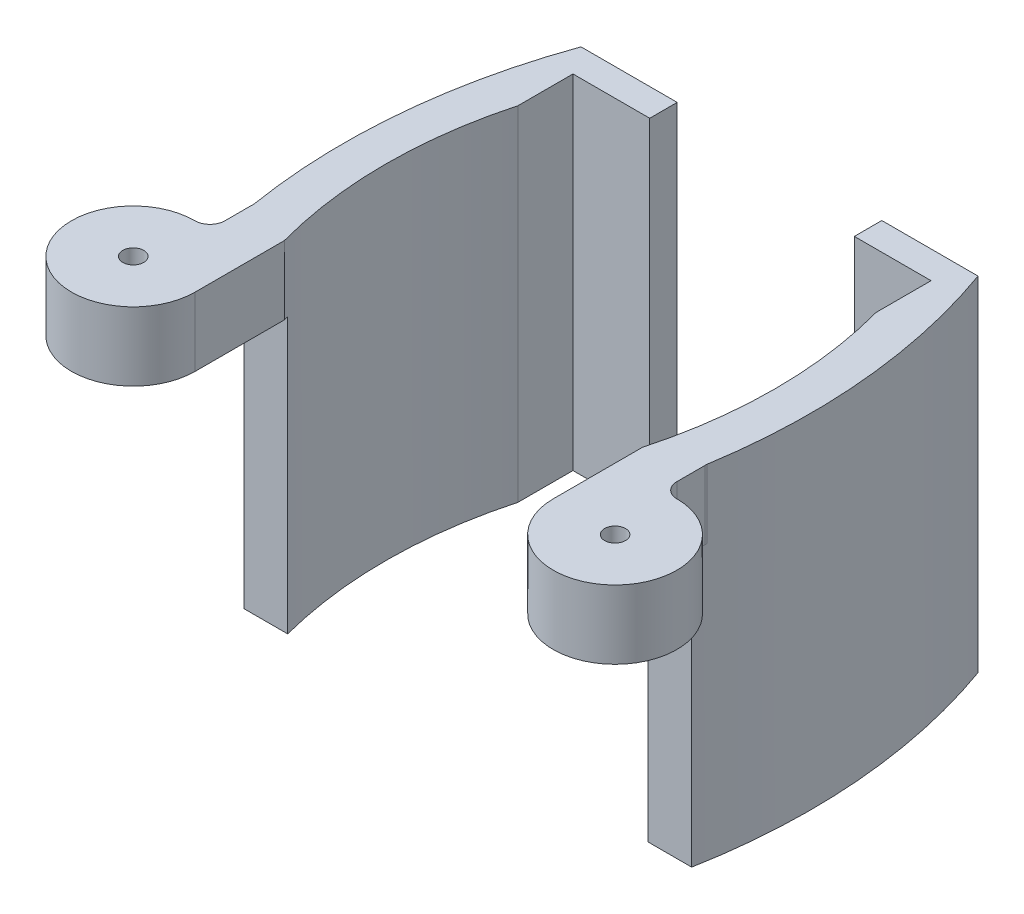
ISO-10303-21;
HEADER;
FILE_DESCRIPTION(('STEP AP214'),'2;1');
FILE_NAME('part.step','',(''),(''),'','','');
FILE_SCHEMA(('AUTOMOTIVE_DESIGN { 1 0 10303 214 1 1 1 1 }'));
ENDSEC;
DATA;
#1=APPLICATION_CONTEXT('core data for automotive mechanical design processes');
#2=APPLICATION_PROTOCOL_DEFINITION('international standard','automotive_design',2000,#1);
#3=PRODUCT_CONTEXT('',#1,'mechanical');
#4=PRODUCT('Part','Part','',(#3));
#5=PRODUCT_RELATED_PRODUCT_CATEGORY('part','',(#4));
#6=PRODUCT_DEFINITION_FORMATION('','',#4);
#7=PRODUCT_DEFINITION_CONTEXT('part definition',#1,'design');
#8=PRODUCT_DEFINITION('design','',#6,#7);
#9=PRODUCT_DEFINITION_SHAPE('','',#8);
#10=(LENGTH_UNIT() NAMED_UNIT(*) SI_UNIT(.MILLI.,.METRE.));
#11=(NAMED_UNIT(*) PLANE_ANGLE_UNIT() SI_UNIT($,.RADIAN.));
#12=(NAMED_UNIT(*) SI_UNIT($,.STERADIAN.) SOLID_ANGLE_UNIT());
#13=UNCERTAINTY_MEASURE_WITH_UNIT(LENGTH_MEASURE(1.E-05),#10,'distance_accuracy_value','');
#14=(GEOMETRIC_REPRESENTATION_CONTEXT(3) GLOBAL_UNCERTAINTY_ASSIGNED_CONTEXT((#13)) GLOBAL_UNIT_ASSIGNED_CONTEXT((#10,
#11,#12)) REPRESENTATION_CONTEXT('',''));
#15=CARTESIAN_POINT('',(0.,0.,0.));
#16=DIRECTION('',(0.,0.,1.));
#17=DIRECTION('',(1.,0.,0.));
#18=AXIS2_PLACEMENT_3D('',#15,#16,#17);
#19=CARTESIAN_POINT('',(17.3622752980796,0.,39.2467313511501));
#20=DIRECTION('',(0.,1.,0.));
#21=DIRECTION('',(0.,0.,1.));
#22=AXIS2_PLACEMENT_3D('',#19,#20,#21);
#23=PLANE('',#22);
#24=CARTESIAN_POINT('',(-70.9798633622335,0.,68.7645288120233));
#25=DIRECTION('',(0.,1.,0.));
#26=DIRECTION('',(0.,0.,1.));
#27=AXIS2_PLACEMENT_3D('',#24,#25,#26);
#28=CIRCLE('',#27,1.525);
#29=CARTESIAN_POINT('',(-70.9798633622335,0.,70.2895288120233));
#30=VERTEX_POINT('',#29);
#31=EDGE_CURVE('E238',#30,#30,#28,.T.);
#32=ORIENTED_EDGE('',*,*,#31,.F.);
#33=EDGE_LOOP('',(#32));
#34=FACE_BOUND('',#33,.T.);
#35=CARTESIAN_POINT('',(-70.9698282124346,0.,57.6104127686324));
#36=DIRECTION('',(0.,1.,0.));
#37=DIRECTION('',(0.,0.,1.));
#38=AXIS2_PLACEMENT_3D('',#35,#36,#37);
#39=CIRCLE('',#38,2.16920970238459);
#40=CARTESIAN_POINT('',(-70.9698282124346,0.,59.779622471017));
#41=VERTEX_POINT('',#40);
#42=CARTESIAN_POINT('',(-68.8006185100501,0.,57.6104127686324));
#43=VERTEX_POINT('',#42);
#44=EDGE_CURVE('E224',#41,#43,#39,.T.);
#45=ORIENTED_EDGE('',*,*,#44,.F.);
#46=CARTESIAN_POINT('',(-70.9949219793532,0.,68.7645288120234));
#47=DIRECTION('',(0.,1.,0.));
#48=DIRECTION('',(0.,0.,1.));
#49=AXIS2_PLACEMENT_3D('',#46,#47,#48);
#50=CIRCLE('',#49,8.9849413828803);
#51=CARTESIAN_POINT('',(-79.9798633622335,0.,68.7645288120233));
#52=VERTEX_POINT('',#51);
#53=EDGE_CURVE('E227',#41,#52,#50,.T.);
#54=ORIENTED_EDGE('',*,*,#53,.T.);
#55=CARTESIAN_POINT('',(-70.9798633622335,0.,68.7645288120233));
#56=DIRECTION('',(0.,1.,0.));
#57=DIRECTION('',(0.,0.,1.));
#58=AXIS2_PLACEMENT_3D('',#55,#56,#57);
#59=CIRCLE('',#58,9.00000000000001);
#60=CARTESIAN_POINT('',(-61.9798633622335,0.,68.7645288120233));
#61=VERTEX_POINT('',#60);
#62=EDGE_CURVE('E206',#52,#61,#59,.T.);
#63=ORIENTED_EDGE('',*,*,#62,.T.);
#64=DIRECTION('',(0.,0.,-1.));
#65=VECTOR('',#64,1.);
#66=CARTESIAN_POINT('',(-61.9798633622335,0.,63.7645288120233));
#67=LINE('',#66,#65);
#68=CARTESIAN_POINT('',(-61.9798633622335,0.,55.7645288120233));
#69=VERTEX_POINT('',#68);
#70=EDGE_CURVE('E142',#61,#69,#67,.T.);
#71=ORIENTED_EDGE('',*,*,#70,.T.);
#72=CARTESIAN_POINT('',(0.34316608916593,0.,38.7645288120234));
#73=DIRECTION('',(0.,-1.,0.));
#74=DIRECTION('',(0.,0.,-1.));
#75=AXIS2_PLACEMENT_3D('',#72,#73,#74);
#76=CIRCLE('',#75,64.6);
#77=CARTESIAN_POINT('',(-61.9798633622335,0.,21.7645288120234));
#78=VERTEX_POINT('',#77);
#79=EDGE_CURVE('E140',#69,#78,#76,.T.);
#80=ORIENTED_EDGE('',*,*,#79,.T.);
#81=DIRECTION('',(0.,0.,-1.));
#82=VECTOR('',#81,1.);
#83=CARTESIAN_POINT('',(-61.9798633622335,0.,21.7645288120234));
#84=LINE('',#83,#82);
#85=CARTESIAN_POINT('',(-61.9798633622335,0.,13.7645288120234));
#86=VERTEX_POINT('',#85);
#87=EDGE_CURVE('E123',#78,#86,#84,.T.);
#88=ORIENTED_EDGE('',*,*,#87,.T.);
#89=DIRECTION('',(1.,0.,0.));
#90=VECTOR('',#89,1.);
#91=CARTESIAN_POINT('',(-61.9798633622335,0.,13.7645288120234));
#92=LINE('',#91,#90);
#93=CARTESIAN_POINT('',(-50.8100577018505,0.,13.7645288120234));
#94=VERTEX_POINT('',#93);
#95=EDGE_CURVE('E131',#86,#94,#92,.T.);
#96=ORIENTED_EDGE('',*,*,#95,.T.);
#97=DIRECTION('',(0.,0.,-1.));
#98=VECTOR('',#97,1.);
#99=CARTESIAN_POINT('',(-50.8100577018505,0.,13.7645288120234));
#100=LINE('',#99,#98);
#101=CARTESIAN_POINT('',(-50.8100577018505,0.,9.76452881202337));
#102=VERTEX_POINT('',#101);
#103=EDGE_CURVE('E136',#94,#102,#100,.T.);
#104=ORIENTED_EDGE('',*,*,#103,.T.);
#105=DIRECTION('',(-1.,0.,0.));
#106=VECTOR('',#105,1.);
#107=CARTESIAN_POINT('',(-50.8100577018505,0.,9.76452881202337));
#108=LINE('',#107,#106);
#109=CARTESIAN_POINT('',(-64.8100577018505,0.,9.76452881202337));
#110=VERTEX_POINT('',#109);
#111=EDGE_CURVE('E160',#102,#110,#108,.T.);
#112=ORIENTED_EDGE('',*,*,#111,.T.);
#113=CARTESIAN_POINT('',(17.3622752980796,0.,39.2467313511501));
#114=DIRECTION('',(0.,1.,0.));
#115=DIRECTION('',(0.,0.,1.));
#116=AXIS2_PLACEMENT_3D('',#113,#114,#115);
#117=CIRCLE('',#116,87.3011602283125);
#118=CARTESIAN_POINT('',(-68.8006185100501,0.,53.298361428065));
#119=VERTEX_POINT('',#118);
#120=EDGE_CURVE('E64',#110,#119,#117,.T.);
#121=ORIENTED_EDGE('',*,*,#120,.T.);
#122=CARTESIAN_POINT('',(-70.0805033457437,0.,53.507087800374));
#123=DIRECTION('',(0.,-1.,0.));
#124=DIRECTION('',(0.,0.,1.));
#125=AXIS2_PLACEMENT_3D('',#122,#123,#124);
#126=CIRCLE('',#125,1.29679292531065);
#127=CARTESIAN_POINT('',(-68.8006185100501,0.,53.7158141726829));
#128=VERTEX_POINT('',#127);
#129=EDGE_CURVE('E196',#119,#128,#126,.T.);
#130=ORIENTED_EDGE('',*,*,#129,.T.);
#131=DIRECTION('',(0.,0.,1.));
#132=VECTOR('',#131,1.);
#133=CARTESIAN_POINT('',(-68.8006185100501,0.,0.));
#134=LINE('',#133,#132);
#135=EDGE_CURVE('E220',#128,#43,#134,.T.);
#136=ORIENTED_EDGE('',*,*,#135,.T.);
#137=EDGE_LOOP('',(#45,#54,#63,#71,#80,#88,#96,#104,#112,#121,#130,#136));
#138=FACE_BOUND('',#137,.T.);
#139=ADVANCED_FACE('F55',(#34,#138),#23,.T.);
#140=CARTESIAN_POINT('',(-70.9798633622335,-10.,63.7645288120233));
#141=DIRECTION('',(0.,-1.,0.));
#142=DIRECTION('',(0.,0.,-1.));
#143=AXIS2_PLACEMENT_3D('',#140,#141,#142);
#144=PLANE('',#143);
#145=CARTESIAN_POINT('',(-70.9798633622335,-10.,68.7645288120233));
#146=DIRECTION('',(0.,1.,0.));
#147=DIRECTION('',(0.,0.,1.));
#148=AXIS2_PLACEMENT_3D('',#145,#146,#147);
#149=CIRCLE('',#148,1.525);
#150=CARTESIAN_POINT('',(-70.9798633622335,-10.,70.2895288120233));
#151=VERTEX_POINT('',#150);
#152=EDGE_CURVE('E230',#151,#151,#149,.T.);
#153=ORIENTED_EDGE('',*,*,#152,.T.);
#154=EDGE_LOOP('',(#153));
#155=FACE_BOUND('',#154,.T.);
#156=CARTESIAN_POINT('',(-70.9798633622335,-10.,68.7645288120233));
#157=DIRECTION('',(0.,-1.,0.));
#158=DIRECTION('',(0.,0.,-1.));
#159=AXIS2_PLACEMENT_3D('',#156,#157,#158);
#160=CIRCLE('',#159,9.00000000000001);
#161=CARTESIAN_POINT('',(-79.9798633622335,-10.,68.7645288120233));
#162=VERTEX_POINT('',#161);
#163=CARTESIAN_POINT('',(-61.9798633622335,-10.,68.7645288120233));
#164=VERTEX_POINT('',#163);
#165=EDGE_CURVE('E205',#162,#164,#160,.F.);
#166=ORIENTED_EDGE('',*,*,#165,.F.);
#167=CARTESIAN_POINT('',(-70.9949219793532,-10.,68.7645288120234));
#168=DIRECTION('',(0.,1.,0.));
#169=DIRECTION('',(0.,0.,1.));
#170=AXIS2_PLACEMENT_3D('',#167,#168,#169);
#171=CIRCLE('',#170,8.9849413828803);
#172=CARTESIAN_POINT('',(-70.9698282124346,-10.,59.779622471017));
#173=VERTEX_POINT('',#172);
#174=EDGE_CURVE('E223',#173,#162,#171,.T.);
#175=ORIENTED_EDGE('',*,*,#174,.F.);
#176=CARTESIAN_POINT('',(-70.9698282124346,-10.,57.6104127686324));
#177=DIRECTION('',(0.,1.,0.));
#178=DIRECTION('',(0.,0.,1.));
#179=AXIS2_PLACEMENT_3D('',#176,#177,#178);
#180=CIRCLE('',#179,2.16920970238459);
#181=CARTESIAN_POINT('',(-68.8006185100501,-10.,57.6104127686324));
#182=VERTEX_POINT('',#181);
#183=EDGE_CURVE('E233',#173,#182,#180,.T.);
#184=ORIENTED_EDGE('',*,*,#183,.T.);
#185=DIRECTION('',(0.,0.,1.));
#186=VECTOR('',#185,1.);
#187=CARTESIAN_POINT('',(-68.8006185100501,-10.,0.));
#188=LINE('',#187,#186);
#189=CARTESIAN_POINT('',(-68.8006185100501,-10.,53.7158141726829));
#190=VERTEX_POINT('',#189);
#191=EDGE_CURVE('E217',#190,#182,#188,.T.);
#192=ORIENTED_EDGE('',*,*,#191,.F.);
#193=CARTESIAN_POINT('',(-70.0805033457437,-10.,53.507087800374));
#194=DIRECTION('',(0.,-1.,0.));
#195=DIRECTION('',(0.,0.,1.));
#196=AXIS2_PLACEMENT_3D('',#193,#194,#195);
#197=CIRCLE('',#196,1.29679292531065);
#198=CARTESIAN_POINT('',(-68.8006185100501,-10.,53.298361428065));
#199=VERTEX_POINT('',#198);
#200=EDGE_CURVE('E195',#199,#190,#197,.T.);
#201=ORIENTED_EDGE('',*,*,#200,.F.);
#202=CARTESIAN_POINT('',(17.3622752980796,-10.,39.2467313511501));
#203=DIRECTION('',(0.,1.,0.));
#204=DIRECTION('',(0.,0.,1.));
#205=AXIS2_PLACEMENT_3D('',#202,#203,#204);
#206=CIRCLE('',#205,87.3011602283125);
#207=CARTESIAN_POINT('',(-68.4841691205783,-10.,55.1174766986052));
#208=VERTEX_POINT('',#207);
#209=EDGE_CURVE('E187',#208,#199,#206,.F.);
#210=ORIENTED_EDGE('',*,*,#209,.F.);
#211=DIRECTION('',(1.,0.,0.));
#212=VECTOR('',#211,1.);
#213=CARTESIAN_POINT('',(-68.4841691205783,-10.,55.1174766986052));
#214=LINE('',#213,#212);
#215=CARTESIAN_POINT('',(-62.1527625415756,-10.,55.1174766986052));
#216=VERTEX_POINT('',#215);
#217=EDGE_CURVE('E183',#208,#216,#214,.T.);
#218=ORIENTED_EDGE('',*,*,#217,.T.);
#219=CARTESIAN_POINT('',(0.34316608916593,-10.,38.7645288120234));
#220=DIRECTION('',(0.,-1.,0.));
#221=DIRECTION('',(0.,0.,-1.));
#222=AXIS2_PLACEMENT_3D('',#219,#220,#221);
#223=CIRCLE('',#222,64.6);
#224=CARTESIAN_POINT('',(-61.9798633622335,-10.,55.7645288120233));
#225=VERTEX_POINT('',#224);
#226=EDGE_CURVE('E170',#225,#216,#223,.T.);
#227=ORIENTED_EDGE('',*,*,#226,.F.);
#228=DIRECTION('',(0.,0.,-1.));
#229=VECTOR('',#228,1.);
#230=CARTESIAN_POINT('',(-61.9798633622335,-10.,63.7645288120233));
#231=LINE('',#230,#229);
#232=EDGE_CURVE('E178',#164,#225,#231,.T.);
#233=ORIENTED_EDGE('',*,*,#232,.F.);
#234=EDGE_LOOP('',(#166,#175,#184,#192,#201,#210,#218,#227,#233));
#235=FACE_BOUND('',#234,.T.);
#236=ADVANCED_FACE('F244',(#155,#235),#144,.T.);
#237=CARTESIAN_POINT('',(-70.0805033457437,-10.,53.507087800374));
#238=DIRECTION('',(0.,1.,0.));
#239=DIRECTION('',(0.,0.,1.));
#240=AXIS2_PLACEMENT_3D('',#237,#238,#239);
#241=CYLINDRICAL_SURFACE('',#240,1.29679292531065);
#242=ORIENTED_EDGE('',*,*,#200,.T.);
#243=DIRECTION('',(0.,1.,0.));
#244=VECTOR('',#243,1.);
#245=CARTESIAN_POINT('',(-68.8006185100501,-10.,53.7158141726829));
#246=LINE('',#245,#244);
#247=EDGE_CURVE('E12',#190,#128,#246,.T.);
#248=ORIENTED_EDGE('',*,*,#247,.T.);
#249=ORIENTED_EDGE('',*,*,#129,.F.);
#250=DIRECTION('',(0.,1.,0.));
#251=VECTOR('',#250,1.);
#252=CARTESIAN_POINT('',(-68.8006185100501,-10.,53.298361428065));
#253=LINE('',#252,#251);
#254=EDGE_CURVE('E192',#199,#119,#253,.T.);
#255=ORIENTED_EDGE('',*,*,#254,.F.);
#256=EDGE_LOOP('',(#242,#248,#249,#255));
#257=FACE_BOUND('',#256,.T.);
#258=ADVANCED_FACE('F258',(#257),#241,.F.);
#259=CARTESIAN_POINT('',(-61.9798633622335,-50.,63.7645288120233));
#260=DIRECTION('',(1.,0.,0.));
#261=DIRECTION('',(0.,0.,-1.));
#262=AXIS2_PLACEMENT_3D('',#259,#260,#261);
#263=PLANE('',#262);
#264=ORIENTED_EDGE('',*,*,#70,.F.);
#265=DIRECTION('',(0.,1.,0.));
#266=VECTOR('',#265,1.);
#267=CARTESIAN_POINT('',(-61.9798633622335,-32.8035085019828,68.7645288120233));
#268=LINE('',#267,#266);
#269=EDGE_CURVE('E199',#164,#61,#268,.T.);
#270=ORIENTED_EDGE('',*,*,#269,.F.);
#271=ORIENTED_EDGE('',*,*,#232,.T.);
#272=DIRECTION('',(0.,1.,0.));
#273=VECTOR('',#272,1.);
#274=CARTESIAN_POINT('',(-61.9798633622335,-50.,55.7645288120233));
#275=LINE('',#274,#273);
#276=EDGE_CURVE('E72',#225,#69,#275,.T.);
#277=ORIENTED_EDGE('',*,*,#276,.T.);
#278=EDGE_LOOP('',(#264,#270,#271,#277));
#279=FACE_BOUND('',#278,.T.);
#280=ADVANCED_FACE('F276',(#279),#263,.T.);
#281=CARTESIAN_POINT('',(17.3622752980796,-50.,39.2467313511501));
#282=DIRECTION('',(0.,1.,0.));
#283=DIRECTION('',(0.,0.,1.));
#284=AXIS2_PLACEMENT_3D('',#281,#282,#283);
#285=CYLINDRICAL_SURFACE('',#284,87.3011602283125);
#286=ORIENTED_EDGE('',*,*,#254,.T.);
#287=ORIENTED_EDGE('',*,*,#120,.F.);
#288=DIRECTION('',(0.,1.,0.));
#289=VECTOR('',#288,1.);
#290=CARTESIAN_POINT('',(-64.8100577018505,-50.,9.76452881202337));
#291=LINE('',#290,#289);
#292=CARTESIAN_POINT('',(-64.8100577018505,-50.,9.76452881202337));
#293=VERTEX_POINT('',#292);
#294=EDGE_CURVE('E109',#293,#110,#291,.T.);
#295=ORIENTED_EDGE('',*,*,#294,.F.);
#296=CARTESIAN_POINT('',(17.3622752980796,-50.,39.2467313511501));
#297=DIRECTION('',(0.,1.,0.));
#298=DIRECTION('',(0.,0.,1.));
#299=AXIS2_PLACEMENT_3D('',#296,#297,#298);
#300=CIRCLE('',#299,87.3011602283125);
#301=CARTESIAN_POINT('',(-68.4841691205783,-50.,55.1174766986052));
#302=VERTEX_POINT('',#301);
#303=EDGE_CURVE('E158',#293,#302,#300,.T.);
#304=ORIENTED_EDGE('',*,*,#303,.T.);
#305=DIRECTION('',(0.,1.,0.));
#306=VECTOR('',#305,1.);
#307=CARTESIAN_POINT('',(-68.4841691205783,-50.,55.1174766986052));
#308=LINE('',#307,#306);
#309=EDGE_CURVE('E152',#302,#208,#308,.T.);
#310=ORIENTED_EDGE('',*,*,#309,.T.);
#311=ORIENTED_EDGE('',*,*,#209,.T.);
#312=EDGE_LOOP('',(#286,#287,#295,#304,#310,#311));
#313=FACE_BOUND('',#312,.T.);
#314=ADVANCED_FACE('F265',(#313),#285,.T.);
#315=CARTESIAN_POINT('',(-50.8100577018505,-50.,9.76452881202337));
#316=DIRECTION('',(0.,0.,-1.));
#317=DIRECTION('',(-1.,0.,0.));
#318=AXIS2_PLACEMENT_3D('',#315,#316,#317);
#319=PLANE('',#318);
#320=ORIENTED_EDGE('',*,*,#111,.F.);
#321=DIRECTION('',(0.,1.,0.));
#322=VECTOR('',#321,1.);
#323=CARTESIAN_POINT('',(-50.8100577018505,-50.,9.76452881202337));
#324=LINE('',#323,#322);
#325=CARTESIAN_POINT('',(-50.8100577018505,-50.,9.76452881202337));
#326=VERTEX_POINT('',#325);
#327=EDGE_CURVE('E169',#326,#102,#324,.T.);
#328=ORIENTED_EDGE('',*,*,#327,.F.);
#329=DIRECTION('',(-1.,0.,0.));
#330=VECTOR('',#329,1.);
#331=CARTESIAN_POINT('',(-50.8100577018505,-50.,9.76452881202337));
#332=LINE('',#331,#330);
#333=EDGE_CURVE('E149',#326,#293,#332,.T.);
#334=ORIENTED_EDGE('',*,*,#333,.T.);
#335=ORIENTED_EDGE('',*,*,#294,.T.);
#336=EDGE_LOOP('',(#320,#328,#334,#335));
#337=FACE_BOUND('',#336,.T.);
#338=ADVANCED_FACE('F261',(#337),#319,.T.);
#339=CARTESIAN_POINT('',(-50.8100577018505,-50.,13.7645288120234));
#340=DIRECTION('',(1.,0.,0.));
#341=DIRECTION('',(0.,0.,-1.));
#342=AXIS2_PLACEMENT_3D('',#339,#340,#341);
#343=PLANE('',#342);
#344=ORIENTED_EDGE('',*,*,#103,.F.);
#345=DIRECTION('',(0.,1.,0.));
#346=VECTOR('',#345,1.);
#347=CARTESIAN_POINT('',(-50.8100577018505,-50.,13.7645288120234));
#348=LINE('',#347,#346);
#349=CARTESIAN_POINT('',(-50.8100577018505,-50.,13.7645288120234));
#350=VERTEX_POINT('',#349);
#351=EDGE_CURVE('E128',#350,#94,#348,.T.);
#352=ORIENTED_EDGE('',*,*,#351,.F.);
#353=DIRECTION('',(0.,0.,-1.));
#354=VECTOR('',#353,1.);
#355=CARTESIAN_POINT('',(-50.8100577018505,-50.,13.7645288120234));
#356=LINE('',#355,#354);
#357=EDGE_CURVE('E151',#350,#326,#356,.T.);
#358=ORIENTED_EDGE('',*,*,#357,.T.);
#359=ORIENTED_EDGE('',*,*,#327,.T.);
#360=EDGE_LOOP('',(#344,#352,#358,#359));
#361=FACE_BOUND('',#360,.T.);
#362=ADVANCED_FACE('F264',(#361),#343,.T.);
#363=CARTESIAN_POINT('',(-61.9798633622335,-50.,13.7645288120234));
#364=DIRECTION('',(0.,0.,1.));
#365=DIRECTION('',(1.,0.,0.));
#366=AXIS2_PLACEMENT_3D('',#363,#364,#365);
#367=PLANE('',#366);
#368=ORIENTED_EDGE('',*,*,#95,.F.);
#369=DIRECTION('',(0.,1.,0.));
#370=VECTOR('',#369,1.);
#371=CARTESIAN_POINT('',(-61.9798633622335,-50.,13.7645288120234));
#372=LINE('',#371,#370);
#373=CARTESIAN_POINT('',(-61.9798633622335,-50.,13.7645288120234));
#374=VERTEX_POINT('',#373);
#375=EDGE_CURVE('E94',#374,#86,#372,.T.);
#376=ORIENTED_EDGE('',*,*,#375,.F.);
#377=DIRECTION('',(1.,0.,0.));
#378=VECTOR('',#377,1.);
#379=CARTESIAN_POINT('',(-61.9798633622335,-50.,13.7645288120234));
#380=LINE('',#379,#378);
#381=EDGE_CURVE('E155',#374,#350,#380,.T.);
#382=ORIENTED_EDGE('',*,*,#381,.T.);
#383=ORIENTED_EDGE('',*,*,#351,.T.);
#384=EDGE_LOOP('',(#368,#376,#382,#383));
#385=FACE_BOUND('',#384,.T.);
#386=ADVANCED_FACE('F132',(#385),#367,.T.);
#387=CARTESIAN_POINT('',(-61.9798633622335,-50.,21.7645288120234));
#388=DIRECTION('',(1.,0.,0.));
#389=DIRECTION('',(0.,0.,-1.));
#390=AXIS2_PLACEMENT_3D('',#387,#388,#389);
#391=PLANE('',#390);
#392=ORIENTED_EDGE('',*,*,#87,.F.);
#393=DIRECTION('',(0.,1.,0.));
#394=VECTOR('',#393,1.);
#395=CARTESIAN_POINT('',(-61.9798633622335,-50.,21.7645288120234));
#396=LINE('',#395,#394);
#397=CARTESIAN_POINT('',(-61.9798633622335,-50.,21.7645288120234));
#398=VERTEX_POINT('',#397);
#399=EDGE_CURVE('E127',#398,#78,#396,.T.);
#400=ORIENTED_EDGE('',*,*,#399,.F.);
#401=DIRECTION('',(0.,0.,-1.));
#402=VECTOR('',#401,1.);
#403=CARTESIAN_POINT('',(-61.9798633622335,-50.,21.7645288120234));
#404=LINE('',#403,#402);
#405=EDGE_CURVE('E126',#398,#374,#404,.T.);
#406=ORIENTED_EDGE('',*,*,#405,.T.);
#407=ORIENTED_EDGE('',*,*,#375,.T.);
#408=EDGE_LOOP('',(#392,#400,#406,#407));
#409=FACE_BOUND('',#408,.T.);
#410=ADVANCED_FACE('F121',(#409),#391,.T.);
#411=CARTESIAN_POINT('',(0.34316608916593,-50.,38.7645288120234));
#412=DIRECTION('',(0.,1.,0.));
#413=DIRECTION('',(0.,0.,1.));
#414=AXIS2_PLACEMENT_3D('',#411,#412,#413);
#415=CYLINDRICAL_SURFACE('',#414,64.6);
#416=DIRECTION('',(0.,1.,0.));
#417=VECTOR('',#416,1.);
#418=CARTESIAN_POINT('',(-62.1527625415756,-50.,55.1174766986052));
#419=LINE('',#418,#417);
#420=CARTESIAN_POINT('',(-62.1527625415756,-50.,55.1174766986052));
#421=VERTEX_POINT('',#420);
#422=EDGE_CURVE('E180',#421,#216,#419,.T.);
#423=ORIENTED_EDGE('',*,*,#422,.F.);
#424=CARTESIAN_POINT('',(0.34316608916593,-50.,38.7645288120234));
#425=DIRECTION('',(0.,-1.,0.));
#426=DIRECTION('',(0.,0.,-1.));
#427=AXIS2_PLACEMENT_3D('',#424,#425,#426);
#428=CIRCLE('',#427,64.6);
#429=EDGE_CURVE('E101',#421,#398,#428,.T.);
#430=ORIENTED_EDGE('',*,*,#429,.T.);
#431=ORIENTED_EDGE('',*,*,#399,.T.);
#432=ORIENTED_EDGE('',*,*,#79,.F.);
#433=ORIENTED_EDGE('',*,*,#276,.F.);
#434=ORIENTED_EDGE('',*,*,#226,.T.);
#435=EDGE_LOOP('',(#423,#430,#431,#432,#433,#434));
#436=FACE_BOUND('',#435,.T.);
#437=ADVANCED_FACE('F273',(#436),#415,.F.);
#438=CARTESIAN_POINT('',(17.3622752980796,-50.,39.2467313511501));
#439=DIRECTION('',(0.,1.,0.));
#440=DIRECTION('',(0.,0.,1.));
#441=AXIS2_PLACEMENT_3D('',#438,#439,#440);
#442=PLANE('',#441);
#443=ORIENTED_EDGE('',*,*,#429,.F.);
#444=DIRECTION('',(1.,0.,0.));
#445=VECTOR('',#444,1.);
#446=CARTESIAN_POINT('',(-62.1527625415756,-50.,55.1174766986052));
#447=LINE('',#446,#445);
#448=EDGE_CURVE('E184',#302,#421,#447,.T.);
#449=ORIENTED_EDGE('',*,*,#448,.F.);
#450=ORIENTED_EDGE('',*,*,#303,.F.);
#451=ORIENTED_EDGE('',*,*,#333,.F.);
#452=ORIENTED_EDGE('',*,*,#357,.F.);
#453=ORIENTED_EDGE('',*,*,#381,.F.);
#454=ORIENTED_EDGE('',*,*,#405,.F.);
#455=EDGE_LOOP('',(#443,#449,#450,#451,#452,#453,#454));
#456=FACE_BOUND('',#455,.T.);
#457=ADVANCED_FACE('F57',(#456),#442,.F.);
#458=CARTESIAN_POINT('',(-62.1527625415756,-10.,55.1174766986052));
#459=DIRECTION('',(0.,0.,-1.));
#460=DIRECTION('',(-1.,0.,0.));
#461=AXIS2_PLACEMENT_3D('',#458,#459,#460);
#462=PLANE('',#461);
#463=ORIENTED_EDGE('',*,*,#422,.T.);
#464=ORIENTED_EDGE('',*,*,#217,.F.);
#465=ORIENTED_EDGE('',*,*,#309,.F.);
#466=ORIENTED_EDGE('',*,*,#448,.T.);
#467=EDGE_LOOP('',(#463,#464,#465,#466));
#468=FACE_BOUND('',#467,.T.);
#469=ADVANCED_FACE('F281',(#468),#462,.F.);
#470=CARTESIAN_POINT('',(-70.9798633622335,-32.8035085019828,68.7645288120233));
#471=DIRECTION('',(0.,1.,0.));
#472=DIRECTION('',(0.,0.,1.));
#473=AXIS2_PLACEMENT_3D('',#470,#471,#472);
#474=CYLINDRICAL_SURFACE('',#473,9.00000000000001);
#475=DIRECTION('',(0.,1.,0.));
#476=VECTOR('',#475,1.);
#477=CARTESIAN_POINT('',(-79.9798633622335,-32.8035085019828,68.7645288120233));
#478=LINE('',#477,#476);
#479=EDGE_CURVE('E202',#162,#52,#478,.T.);
#480=ORIENTED_EDGE('',*,*,#479,.F.);
#481=ORIENTED_EDGE('',*,*,#165,.T.);
#482=ORIENTED_EDGE('',*,*,#269,.T.);
#483=ORIENTED_EDGE('',*,*,#62,.F.);
#484=EDGE_LOOP('',(#480,#481,#482,#483));
#485=FACE_BOUND('',#484,.T.);
#486=ADVANCED_FACE('F284',(#485),#474,.T.);
#487=CARTESIAN_POINT('',(-70.9949219793532,-10.,68.7645288120234));
#488=DIRECTION('',(0.,1.,0.));
#489=DIRECTION('',(0.,0.,1.));
#490=AXIS2_PLACEMENT_3D('',#487,#488,#489);
#491=CYLINDRICAL_SURFACE('',#490,8.9849413828803);
#492=ORIENTED_EDGE('',*,*,#53,.F.);
#493=DIRECTION('',(0.,1.,0.));
#494=VECTOR('',#493,1.);
#495=CARTESIAN_POINT('',(-70.9698282124346,-10.,59.779622471017));
#496=LINE('',#495,#494);
#497=EDGE_CURVE('E214',#173,#41,#496,.T.);
#498=ORIENTED_EDGE('',*,*,#497,.F.);
#499=ORIENTED_EDGE('',*,*,#174,.T.);
#500=ORIENTED_EDGE('',*,*,#479,.T.);
#501=EDGE_LOOP('',(#492,#498,#499,#500));
#502=FACE_BOUND('',#501,.T.);
#503=ADVANCED_FACE('F291',(#502),#491,.T.);
#504=CARTESIAN_POINT('',(-68.8006185100501,-10.,0.));
#505=DIRECTION('',(-1.,0.,0.));
#506=DIRECTION('',(0.,0.,1.));
#507=AXIS2_PLACEMENT_3D('',#504,#505,#506);
#508=PLANE('',#507);
#509=ORIENTED_EDGE('',*,*,#191,.T.);
#510=DIRECTION('',(0.,1.,0.));
#511=VECTOR('',#510,1.);
#512=CARTESIAN_POINT('',(-68.8006185100501,-10.,57.6104127686324));
#513=LINE('',#512,#511);
#514=EDGE_CURVE('E213',#182,#43,#513,.T.);
#515=ORIENTED_EDGE('',*,*,#514,.T.);
#516=ORIENTED_EDGE('',*,*,#135,.F.);
#517=ORIENTED_EDGE('',*,*,#247,.F.);
#518=EDGE_LOOP('',(#509,#515,#516,#517));
#519=FACE_BOUND('',#518,.T.);
#520=ADVANCED_FACE('F295',(#519),#508,.T.);
#521=CARTESIAN_POINT('',(-70.9698282124346,-10.,57.6104127686324));
#522=DIRECTION('',(0.,1.,0.));
#523=DIRECTION('',(0.,0.,1.));
#524=AXIS2_PLACEMENT_3D('',#521,#522,#523);
#525=CYLINDRICAL_SURFACE('',#524,2.16920970238459);
#526=ORIENTED_EDGE('',*,*,#44,.T.);
#527=ORIENTED_EDGE('',*,*,#514,.F.);
#528=ORIENTED_EDGE('',*,*,#183,.F.);
#529=ORIENTED_EDGE('',*,*,#497,.T.);
#530=EDGE_LOOP('',(#526,#527,#528,#529));
#531=FACE_BOUND('',#530,.T.);
#532=ADVANCED_FACE('F250',(#531),#525,.F.);
#533=CARTESIAN_POINT('',(-70.9798633622335,-10.,68.7645288120233));
#534=DIRECTION('',(0.,1.,0.));
#535=DIRECTION('',(0.,0.,1.));
#536=AXIS2_PLACEMENT_3D('',#533,#534,#535);
#537=CYLINDRICAL_SURFACE('',#536,1.525);
#538=ORIENTED_EDGE('',*,*,#152,.F.);
#539=EDGE_LOOP('',(#538));
#540=FACE_BOUND('',#539,.T.);
#541=ORIENTED_EDGE('',*,*,#31,.T.);
#542=EDGE_LOOP('',(#541));
#543=FACE_BOUND('',#542,.T.);
#544=ADVANCED_FACE('F247',(#540,#543),#537,.F.);
#545=CLOSED_SHELL('',(#139,#236,#258,#280,#314,#338,#362,#386,#410,#437,#457,#469,#486,#503,
#520,#532,#544));
#546=MANIFOLD_SOLID_BREP('B2_NOT_SHOWN',#545);
#547=CARTESIAN_POINT('',(-9.85551112134364,-50.,63.7645288120234));
#548=DIRECTION('',(-1.,0.,0.));
#549=DIRECTION('',(0.,0.,1.));
#550=AXIS2_PLACEMENT_3D('',#547,#548,#549);
#551=PLANE('',#550);
#552=DIRECTION('',(0.,1.,0.));
#553=VECTOR('',#552,1.);
#554=CARTESIAN_POINT('',(-9.85551112134364,-50.,55.7645288120234));
#555=LINE('',#554,#553);
#556=CARTESIAN_POINT('',(-9.85551112134364,-10.,55.7645288120234));
#557=VERTEX_POINT('',#556);
#558=CARTESIAN_POINT('',(-9.85551112134364,0.,55.7645288120234));
#559=VERTEX_POINT('',#558);
#560=EDGE_CURVE('E535',#557,#559,#555,.T.);
#561=ORIENTED_EDGE('',*,*,#560,.F.);
#562=DIRECTION('',(0.,0.,1.));
#563=VECTOR('',#562,1.);
#564=CARTESIAN_POINT('',(-9.85551112134364,-10.,63.7645288120234));
#565=LINE('',#564,#563);
#566=CARTESIAN_POINT('',(-9.85551112134364,-10.,68.7645288120233));
#567=VERTEX_POINT('',#566);
#568=EDGE_CURVE('E675',#557,#567,#565,.T.);
#569=ORIENTED_EDGE('',*,*,#568,.T.);
#570=DIRECTION('',(0.,1.,0.));
#571=VECTOR('',#570,1.);
#572=CARTESIAN_POINT('',(-9.85551112134364,-32.8035085019828,68.7645288120233));
#573=LINE('',#572,#571);
#574=CARTESIAN_POINT('',(-9.85551112134364,0.,68.7645288120233));
#575=VERTEX_POINT('',#574);
#576=EDGE_CURVE('E698',#567,#575,#573,.T.);
#577=ORIENTED_EDGE('',*,*,#576,.T.);
#578=DIRECTION('',(0.,0.,1.));
#579=VECTOR('',#578,1.);
#580=CARTESIAN_POINT('',(-9.85551112134364,0.,63.7645288120234));
#581=LINE('',#580,#579);
#582=EDGE_CURVE('E641',#559,#575,#581,.T.);
#583=ORIENTED_EDGE('',*,*,#582,.F.);
#584=EDGE_LOOP('',(#561,#569,#577,#583));
#585=FACE_BOUND('',#584,.T.);
#586=ADVANCED_FACE('F527',(#585),#551,.T.);
#587=CARTESIAN_POINT('',(-72.1785405727431,-50.,38.7645288120234));
#588=DIRECTION('',(0.,1.,0.));
#589=DIRECTION('',(0.,0.,1.));
#590=AXIS2_PLACEMENT_3D('',#587,#588,#589);
#591=CYLINDRICAL_SURFACE('',#590,64.6);
#592=DIRECTION('',(0.,1.,0.));
#593=VECTOR('',#592,1.);
#594=CARTESIAN_POINT('',(-9.68261194200155,-50.,55.1174766986052));
#595=LINE('',#594,#593);
#596=CARTESIAN_POINT('',(-9.68261194200154,-10.,55.1174766986052));
#597=VERTEX_POINT('',#596);
#598=CARTESIAN_POINT('',(-9.68261194200155,-50.,55.1174766986052));
#599=VERTEX_POINT('',#598);
#600=EDGE_CURVE('E678',#597,#599,#595,.F.);
#601=ORIENTED_EDGE('',*,*,#600,.F.);
#602=CARTESIAN_POINT('',(-72.1785405727431,-10.,38.7645288120234));
#603=DIRECTION('',(0.,-1.,0.));
#604=DIRECTION('',(0.,0.,-1.));
#605=AXIS2_PLACEMENT_3D('',#602,#603,#604);
#606=CIRCLE('',#605,64.6);
#607=EDGE_CURVE('E630',#597,#557,#606,.T.);
#608=ORIENTED_EDGE('',*,*,#607,.T.);
#609=ORIENTED_EDGE('',*,*,#560,.T.);
#610=CARTESIAN_POINT('',(-72.1785405727431,0.,38.7645288120234));
#611=DIRECTION('',(0.,-1.,0.));
#612=DIRECTION('',(0.,0.,1.));
#613=AXIS2_PLACEMENT_3D('',#610,#611,#612);
#614=CIRCLE('',#613,64.6);
#615=CARTESIAN_POINT('',(-9.85551112134365,0.,21.7645288120234));
#616=VERTEX_POINT('',#615);
#617=EDGE_CURVE('E639',#616,#559,#614,.T.);
#618=ORIENTED_EDGE('',*,*,#617,.F.);
#619=DIRECTION('',(0.,1.,0.));
#620=VECTOR('',#619,1.);
#621=CARTESIAN_POINT('',(-9.85551112134365,-50.,21.7645288120234));
#622=LINE('',#621,#620);
#623=CARTESIAN_POINT('',(-9.85551112134365,-50.,21.7645288120234));
#624=VERTEX_POINT('',#623);
#625=EDGE_CURVE('E551',#624,#616,#622,.T.);
#626=ORIENTED_EDGE('',*,*,#625,.F.);
#627=CARTESIAN_POINT('',(-72.1785405727431,-50.,38.7645288120234));
#628=DIRECTION('',(0.,-1.,0.));
#629=DIRECTION('',(0.,0.,1.));
#630=AXIS2_PLACEMENT_3D('',#627,#628,#629);
#631=CIRCLE('',#630,64.6);
#632=EDGE_CURVE('E624',#624,#599,#631,.T.);
#633=ORIENTED_EDGE('',*,*,#632,.T.);
#634=EDGE_LOOP('',(#601,#608,#609,#618,#626,#633));
#635=FACE_BOUND('',#634,.T.);
#636=ADVANCED_FACE('F767',(#635),#591,.F.);
#637=CARTESIAN_POINT('',(-9.85551112134364,-50.,21.7645288120234));
#638=DIRECTION('',(-1.,0.,0.));
#639=DIRECTION('',(0.,0.,1.));
#640=AXIS2_PLACEMENT_3D('',#637,#638,#639);
#641=PLANE('',#640);
#642=DIRECTION('',(0.,0.,1.));
#643=VECTOR('',#642,1.);
#644=CARTESIAN_POINT('',(-9.85551112134364,0.,21.7645288120234));
#645=LINE('',#644,#643);
#646=CARTESIAN_POINT('',(-9.85551112134364,0.,13.7645288120234));
#647=VERTEX_POINT('',#646);
#648=EDGE_CURVE('E636',#647,#616,#645,.T.);
#649=ORIENTED_EDGE('',*,*,#648,.F.);
#650=DIRECTION('',(0.,1.,0.));
#651=VECTOR('',#650,1.);
#652=CARTESIAN_POINT('',(-9.85551112134364,-50.,13.7645288120234));
#653=LINE('',#652,#651);
#654=CARTESIAN_POINT('',(-9.85551112134364,-50.,13.7645288120234));
#655=VERTEX_POINT('',#654);
#656=EDGE_CURVE('E604',#655,#647,#653,.T.);
#657=ORIENTED_EDGE('',*,*,#656,.F.);
#658=DIRECTION('',(0.,0.,1.));
#659=VECTOR('',#658,1.);
#660=CARTESIAN_POINT('',(-9.85551112134364,-50.,21.7645288120234));
#661=LINE('',#660,#659);
#662=EDGE_CURVE('E614',#655,#624,#661,.T.);
#663=ORIENTED_EDGE('',*,*,#662,.T.);
#664=ORIENTED_EDGE('',*,*,#625,.T.);
#665=EDGE_LOOP('',(#649,#657,#663,#664));
#666=FACE_BOUND('',#665,.T.);
#667=ADVANCED_FACE('F773',(#666),#641,.T.);
#668=CARTESIAN_POINT('',(-9.85551112134364,-50.,13.7645288120234));
#669=DIRECTION('',(0.,0.,1.));
#670=DIRECTION('',(1.,0.,0.));
#671=AXIS2_PLACEMENT_3D('',#668,#669,#670);
#672=PLANE('',#671);
#673=DIRECTION('',(1.,0.,0.));
#674=VECTOR('',#673,1.);
#675=CARTESIAN_POINT('',(-9.85551112134364,0.,13.7645288120234));
#676=LINE('',#675,#674);
#677=CARTESIAN_POINT('',(-21.0253167817267,0.,13.7645288120234));
#678=VERTEX_POINT('',#677);
#679=EDGE_CURVE('E599',#678,#647,#676,.T.);
#680=ORIENTED_EDGE('',*,*,#679,.F.);
#681=DIRECTION('',(0.,1.,0.));
#682=VECTOR('',#681,1.);
#683=CARTESIAN_POINT('',(-21.0253167817267,-50.,13.7645288120234));
#684=LINE('',#683,#682);
#685=CARTESIAN_POINT('',(-21.0253167817267,-50.,13.7645288120234));
#686=VERTEX_POINT('',#685);
#687=EDGE_CURVE('E594',#686,#678,#684,.T.);
#688=ORIENTED_EDGE('',*,*,#687,.F.);
#689=DIRECTION('',(1.,0.,0.));
#690=VECTOR('',#689,1.);
#691=CARTESIAN_POINT('',(-9.85551112134364,-50.,13.7645288120234));
#692=LINE('',#691,#690);
#693=EDGE_CURVE('E597',#686,#655,#692,.T.);
#694=ORIENTED_EDGE('',*,*,#693,.T.);
#695=ORIENTED_EDGE('',*,*,#656,.T.);
#696=EDGE_LOOP('',(#680,#688,#694,#695));
#697=FACE_BOUND('',#696,.T.);
#698=ADVANCED_FACE('F596',(#697),#672,.T.);
#699=CARTESIAN_POINT('',(-21.0253167817267,-50.,13.7645288120234));
#700=DIRECTION('',(-1.,0.,0.));
#701=DIRECTION('',(0.,0.,1.));
#702=AXIS2_PLACEMENT_3D('',#699,#700,#701);
#703=PLANE('',#702);
#704=DIRECTION('',(0.,0.,1.));
#705=VECTOR('',#704,1.);
#706=CARTESIAN_POINT('',(-21.0253167817267,0.,13.7645288120234));
#707=LINE('',#706,#705);
#708=CARTESIAN_POINT('',(-21.0253167817267,0.,9.76452881202336));
#709=VERTEX_POINT('',#708);
#710=EDGE_CURVE('E633',#709,#678,#707,.T.);
#711=ORIENTED_EDGE('',*,*,#710,.F.);
#712=DIRECTION('',(0.,1.,0.));
#713=VECTOR('',#712,1.);
#714=CARTESIAN_POINT('',(-21.0253167817267,-50.,9.76452881202336));
#715=LINE('',#714,#713);
#716=CARTESIAN_POINT('',(-21.0253167817267,-50.,9.76452881202336));
#717=VERTEX_POINT('',#716);
#718=EDGE_CURVE('E605',#717,#709,#715,.T.);
#719=ORIENTED_EDGE('',*,*,#718,.F.);
#720=DIRECTION('',(0.,0.,1.));
#721=VECTOR('',#720,1.);
#722=CARTESIAN_POINT('',(-21.0253167817267,-50.,13.7645288120234));
#723=LINE('',#722,#721);
#724=EDGE_CURVE('E612',#717,#686,#723,.T.);
#725=ORIENTED_EDGE('',*,*,#724,.T.);
#726=ORIENTED_EDGE('',*,*,#687,.T.);
#727=EDGE_LOOP('',(#711,#719,#725,#726));
#728=FACE_BOUND('',#727,.T.);
#729=ADVANCED_FACE('F616',(#728),#703,.T.);
#730=CARTESIAN_POINT('',(-21.0253167817267,-50.,9.76452881202336));
#731=DIRECTION('',(0.,0.,-1.));
#732=DIRECTION('',(-1.,0.,0.));
#733=AXIS2_PLACEMENT_3D('',#730,#731,#732);
#734=PLANE('',#733);
#735=DIRECTION('',(-1.,0.,0.));
#736=VECTOR('',#735,1.);
#737=CARTESIAN_POINT('',(-21.0253167817267,0.,9.76452881202336));
#738=LINE('',#737,#736);
#739=CARTESIAN_POINT('',(-7.02531678172666,0.,9.76452881202336));
#740=VERTEX_POINT('',#739);
#741=EDGE_CURVE('E629',#740,#709,#738,.T.);
#742=ORIENTED_EDGE('',*,*,#741,.F.);
#743=DIRECTION('',(0.,1.,0.));
#744=VECTOR('',#743,1.);
#745=CARTESIAN_POINT('',(-7.02531678172666,-50.,9.76452881202336));
#746=LINE('',#745,#744);
#747=CARTESIAN_POINT('',(-7.02531678172666,-50.,9.76452881202336));
#748=VERTEX_POINT('',#747);
#749=EDGE_CURVE('E584',#748,#740,#746,.T.);
#750=ORIENTED_EDGE('',*,*,#749,.F.);
#751=DIRECTION('',(-1.,0.,0.));
#752=VECTOR('',#751,1.);
#753=CARTESIAN_POINT('',(-21.0253167817267,-50.,9.76452881202336));
#754=LINE('',#753,#752);
#755=EDGE_CURVE('E617',#748,#717,#754,.T.);
#756=ORIENTED_EDGE('',*,*,#755,.T.);
#757=ORIENTED_EDGE('',*,*,#718,.T.);
#758=EDGE_LOOP('',(#742,#750,#756,#757));
#759=FACE_BOUND('',#758,.T.);
#760=ADVANCED_FACE('F759',(#759),#734,.T.);
#761=CARTESIAN_POINT('',(-89.1976497816567,-50.,39.2467313511501));
#762=DIRECTION('',(0.,1.,0.));
#763=DIRECTION('',(0.,0.,1.));
#764=AXIS2_PLACEMENT_3D('',#761,#762,#763);
#765=CYLINDRICAL_SURFACE('',#764,87.3011602283125);
#766=DIRECTION('',(0.,1.,0.));
#767=VECTOR('',#766,1.);
#768=CARTESIAN_POINT('',(-3.02456392552264,-50.,53.2357217093151));
#769=LINE('',#768,#767);
#770=CARTESIAN_POINT('',(-3.02456392552264,-10.,53.2357217093151));
#771=VERTEX_POINT('',#770);
#772=CARTESIAN_POINT('',(-3.02456392552264,0.,53.2357217093151));
#773=VERTEX_POINT('',#772);
#774=EDGE_CURVE('E681',#771,#773,#769,.T.);
#775=ORIENTED_EDGE('',*,*,#774,.F.);
#776=CARTESIAN_POINT('',(-89.1976497816567,-10.,39.2467313511501));
#777=DIRECTION('',(0.,1.,0.));
#778=DIRECTION('',(0.,0.,1.));
#779=AXIS2_PLACEMENT_3D('',#776,#777,#778);
#780=CIRCLE('',#779,87.3011602283125);
#781=CARTESIAN_POINT('',(-3.35120536299882,-10.,55.1174766986052));
#782=VERTEX_POINT('',#781);
#783=EDGE_CURVE('E670',#771,#782,#780,.F.);
#784=ORIENTED_EDGE('',*,*,#783,.T.);
#785=DIRECTION('',(0.,1.,0.));
#786=VECTOR('',#785,1.);
#787=CARTESIAN_POINT('',(-3.35120536299882,-50.,55.1174766986052));
#788=LINE('',#787,#786);
#789=CARTESIAN_POINT('',(-3.35120536299882,-50.,55.1174766986052));
#790=VERTEX_POINT('',#789);
#791=EDGE_CURVE('E626',#790,#782,#788,.T.);
#792=ORIENTED_EDGE('',*,*,#791,.F.);
#793=CARTESIAN_POINT('',(-89.1976497816567,-50.,39.2467313511501));
#794=DIRECTION('',(0.,1.,0.));
#795=DIRECTION('',(0.,0.,-1.));
#796=AXIS2_PLACEMENT_3D('',#793,#794,#795);
#797=CIRCLE('',#796,87.3011602283125);
#798=EDGE_CURVE('E619',#790,#748,#797,.T.);
#799=ORIENTED_EDGE('',*,*,#798,.T.);
#800=ORIENTED_EDGE('',*,*,#749,.T.);
#801=CARTESIAN_POINT('',(-89.1976497816567,0.,39.2467313511501));
#802=DIRECTION('',(0.,1.,0.));
#803=DIRECTION('',(0.,0.,-1.));
#804=AXIS2_PLACEMENT_3D('',#801,#802,#803);
#805=CIRCLE('',#804,87.3011602283125);
#806=EDGE_CURVE('E627',#773,#740,#805,.T.);
#807=ORIENTED_EDGE('',*,*,#806,.F.);
#808=EDGE_LOOP('',(#775,#784,#792,#799,#800,#807));
#809=FACE_BOUND('',#808,.T.);
#810=ADVANCED_FACE('F529',(#809),#765,.T.);
#811=CARTESIAN_POINT('',(-0.855511121343641,-50.,63.7645288120234));
#812=DIRECTION('',(0.,1.,0.));
#813=DIRECTION('',(0.,0.,1.));
#814=AXIS2_PLACEMENT_3D('',#811,#812,#813);
#815=PLANE('',#814);
#816=ORIENTED_EDGE('',*,*,#798,.F.);
#817=DIRECTION('',(1.,0.,0.));
#818=VECTOR('',#817,1.);
#819=CARTESIAN_POINT('',(-62.1527625415756,-50.,55.1174766986052));
#820=LINE('',#819,#818);
#821=EDGE_CURVE('E662',#599,#790,#820,.T.);
#822=ORIENTED_EDGE('',*,*,#821,.F.);
#823=ORIENTED_EDGE('',*,*,#632,.F.);
#824=ORIENTED_EDGE('',*,*,#662,.F.);
#825=ORIENTED_EDGE('',*,*,#693,.F.);
#826=ORIENTED_EDGE('',*,*,#724,.F.);
#827=ORIENTED_EDGE('',*,*,#755,.F.);
#828=EDGE_LOOP('',(#816,#822,#823,#824,#825,#826,#827));
#829=FACE_BOUND('',#828,.T.);
#830=ADVANCED_FACE('F611',(#829),#815,.F.);
#831=CARTESIAN_POINT('',(-0.855511121343641,0.,63.7645288120234));
#832=DIRECTION('',(0.,1.,0.));
#833=DIRECTION('',(0.,0.,1.));
#834=AXIS2_PLACEMENT_3D('',#831,#832,#833);
#835=PLANE('',#834);
#836=CARTESIAN_POINT('',(-0.855511121343641,0.,68.7645288120233));
#837=DIRECTION('',(0.,1.,0.));
#838=DIRECTION('',(0.,0.,1.));
#839=AXIS2_PLACEMENT_3D('',#836,#837,#838);
#840=CIRCLE('',#839,1.525);
#841=CARTESIAN_POINT('',(-0.855511121343641,0.,70.2895288120233));
#842=VERTEX_POINT('',#841);
#843=EDGE_CURVE('E720',#842,#842,#840,.T.);
#844=ORIENTED_EDGE('',*,*,#843,.F.);
#845=EDGE_LOOP('',(#844));
#846=FACE_BOUND('',#845,.T.);
#847=DIRECTION('',(0.,0.,1.));
#848=VECTOR('',#847,1.);
#849=CARTESIAN_POINT('',(-3.02456392552264,0.,0.));
#850=LINE('',#849,#848);
#851=CARTESIAN_POINT('',(-3.02456392552264,0.,53.5092276835066));
#852=VERTEX_POINT('',#851);
#853=CARTESIAN_POINT('',(-3.02456392552264,0.,57.5954760078444));
#854=VERTEX_POINT('',#853);
#855=EDGE_CURVE('E713',#852,#854,#850,.T.);
#856=ORIENTED_EDGE('',*,*,#855,.F.);
#857=CARTESIAN_POINT('',(-1.62110988332484,0.,53.3836624149525));
#858=DIRECTION('',(0.,-1.,0.));
#859=DIRECTION('',(0.,0.,1.));
#860=AXIS2_PLACEMENT_3D('',#857,#858,#859);
#861=CIRCLE('',#860,1.40905992960853);
#862=CARTESIAN_POINT('',(-3.0222338621668,0.,53.2343256105724));
#863=VERTEX_POINT('',#862);
#864=EDGE_CURVE('E685',#852,#863,#861,.T.);
#865=ORIENTED_EDGE('',*,*,#864,.T.);
#866=DIRECTION('',(-0.857807737804425,0.,0.513970704381927));
#867=VECTOR('',#866,1.);
#868=CARTESIAN_POINT('',(-3.0222338621668,0.,53.2343256105724));
#869=LINE('',#868,#867);
#870=EDGE_CURVE('E542',#863,#773,#869,.T.);
#871=ORIENTED_EDGE('',*,*,#870,.T.);
#872=ORIENTED_EDGE('',*,*,#806,.T.);
#873=ORIENTED_EDGE('',*,*,#741,.T.);
#874=ORIENTED_EDGE('',*,*,#710,.T.);
#875=ORIENTED_EDGE('',*,*,#679,.T.);
#876=ORIENTED_EDGE('',*,*,#648,.T.);
#877=ORIENTED_EDGE('',*,*,#617,.T.);
#878=ORIENTED_EDGE('',*,*,#582,.T.);
#879=CARTESIAN_POINT('',(-0.855511121343641,0.,68.7645288120233));
#880=DIRECTION('',(0.,1.,0.));
#881=DIRECTION('',(0.,0.,1.));
#882=AXIS2_PLACEMENT_3D('',#879,#880,#881);
#883=CIRCLE('',#882,9.);
#884=CARTESIAN_POINT('',(-0.855511121343644,0.,59.7645288120234));
#885=VERTEX_POINT('',#884);
#886=EDGE_CURVE('E697',#575,#885,#883,.T.);
#887=ORIENTED_EDGE('',*,*,#886,.T.);
#888=CARTESIAN_POINT('',(-0.855511121343645,0.,57.5954760078444));
#889=DIRECTION('',(0.,1.,0.));
#890=DIRECTION('',(0.,0.,1.));
#891=AXIS2_PLACEMENT_3D('',#888,#889,#890);
#892=CIRCLE('',#891,2.16905280417899);
#893=EDGE_CURVE('E717',#885,#854,#892,.F.);
#894=ORIENTED_EDGE('',*,*,#893,.T.);
#895=EDGE_LOOP('',(#856,#865,#871,#872,#873,#874,#875,#876,#877,#878,#887,#894));
#896=FACE_BOUND('',#895,.T.);
#897=ADVANCED_FACE('F733',(#846,#896),#835,.T.);
#898=CARTESIAN_POINT('',(-0.855511121343641,-10.,63.7645288120234));
#899=DIRECTION('',(0.,-1.,0.));
#900=DIRECTION('',(0.,0.,-1.));
#901=AXIS2_PLACEMENT_3D('',#898,#899,#900);
#902=PLANE('',#901);
#903=CARTESIAN_POINT('',(-0.855511121343641,-10.,68.7645288120233));
#904=DIRECTION('',(0.,1.,0.));
#905=DIRECTION('',(0.,0.,1.));
#906=AXIS2_PLACEMENT_3D('',#903,#904,#905);
#907=CIRCLE('',#906,1.525);
#908=CARTESIAN_POINT('',(-0.855511121343641,-10.,70.2895288120233));
#909=VERTEX_POINT('',#908);
#910=EDGE_CURVE('E725',#909,#909,#907,.T.);
#911=ORIENTED_EDGE('',*,*,#910,.T.);
#912=EDGE_LOOP('',(#911));
#913=FACE_BOUND('',#912,.T.);
#914=DIRECTION('',(0.,0.,1.));
#915=VECTOR('',#914,1.);
#916=CARTESIAN_POINT('',(-3.02456392552264,-10.,0.));
#917=LINE('',#916,#915);
#918=CARTESIAN_POINT('',(-3.02456392552264,-10.,53.5092276835066));
#919=VERTEX_POINT('',#918);
#920=CARTESIAN_POINT('',(-3.02456392552264,-10.,57.5954760078444));
#921=VERTEX_POINT('',#920);
#922=EDGE_CURVE('E710',#919,#921,#917,.T.);
#923=ORIENTED_EDGE('',*,*,#922,.T.);
#924=CARTESIAN_POINT('',(-0.855511121343645,-10.,57.5954760078444));
#925=DIRECTION('',(0.,1.,0.));
#926=DIRECTION('',(0.,0.,1.));
#927=AXIS2_PLACEMENT_3D('',#924,#925,#926);
#928=CIRCLE('',#927,2.16905280417899);
#929=CARTESIAN_POINT('',(-0.855511121343644,-10.,59.7645288120234));
#930=VERTEX_POINT('',#929);
#931=EDGE_CURVE('E716',#930,#921,#928,.F.);
#932=ORIENTED_EDGE('',*,*,#931,.F.);
#933=CARTESIAN_POINT('',(-0.855511121343641,-10.,68.7645288120233));
#934=DIRECTION('',(0.,-1.,0.));
#935=DIRECTION('',(0.,0.,-1.));
#936=AXIS2_PLACEMENT_3D('',#933,#934,#935);
#937=CIRCLE('',#936,9.);
#938=EDGE_CURVE('E701',#567,#930,#937,.F.);
#939=ORIENTED_EDGE('',*,*,#938,.F.);
#940=ORIENTED_EDGE('',*,*,#568,.F.);
#941=ORIENTED_EDGE('',*,*,#607,.F.);
#942=DIRECTION('',(1.,0.,0.));
#943=VECTOR('',#942,1.);
#944=CARTESIAN_POINT('',(-68.4841691205783,-10.,55.1174766986052));
#945=LINE('',#944,#943);
#946=EDGE_CURVE('E658',#597,#782,#945,.T.);
#947=ORIENTED_EDGE('',*,*,#946,.T.);
#948=ORIENTED_EDGE('',*,*,#783,.F.);
#949=DIRECTION('',(-0.857807737804425,0.,0.513970704381927));
#950=VECTOR('',#949,1.);
#951=CARTESIAN_POINT('',(-3.0222338621668,-10.,53.2343256105724));
#952=LINE('',#951,#950);
#953=CARTESIAN_POINT('',(-3.0222338621668,-10.,53.2343256105724));
#954=VERTEX_POINT('',#953);
#955=EDGE_CURVE('E689',#954,#771,#952,.T.);
#956=ORIENTED_EDGE('',*,*,#955,.F.);
#957=CARTESIAN_POINT('',(-1.62110988332484,-10.,53.3836624149525));
#958=DIRECTION('',(0.,-1.,0.));
#959=DIRECTION('',(0.,0.,1.));
#960=AXIS2_PLACEMENT_3D('',#957,#958,#959);
#961=CIRCLE('',#960,1.40905992960853);
#962=EDGE_CURVE('E686',#919,#954,#961,.T.);
#963=ORIENTED_EDGE('',*,*,#962,.F.);
#964=EDGE_LOOP('',(#923,#932,#939,#940,#941,#947,#948,#956,#963));
#965=FACE_BOUND('',#964,.T.);
#966=ADVANCED_FACE('F735',(#913,#965),#902,.T.);
#967=CARTESIAN_POINT('',(-62.1527625415756,-10.,55.1174766986052));
#968=DIRECTION('',(0.,0.,-1.));
#969=DIRECTION('',(-1.,0.,0.));
#970=AXIS2_PLACEMENT_3D('',#967,#968,#969);
#971=PLANE('',#970);
#972=ORIENTED_EDGE('',*,*,#600,.T.);
#973=ORIENTED_EDGE('',*,*,#821,.T.);
#974=ORIENTED_EDGE('',*,*,#791,.T.);
#975=ORIENTED_EDGE('',*,*,#946,.F.);
#976=EDGE_LOOP('',(#972,#973,#974,#975));
#977=FACE_BOUND('',#976,.T.);
#978=ADVANCED_FACE('F655',(#977),#971,.F.);
#979=CARTESIAN_POINT('',(-1.62110988332484,-10.,53.3836624149525));
#980=DIRECTION('',(0.,1.,0.));
#981=DIRECTION('',(0.,0.,1.));
#982=AXIS2_PLACEMENT_3D('',#979,#980,#981);
#983=CYLINDRICAL_SURFACE('',#982,1.40905992960853);
#984=DIRECTION('',(0.,1.,0.));
#985=VECTOR('',#984,1.);
#986=CARTESIAN_POINT('',(-3.0222338621668,-10.,53.2343256105724));
#987=LINE('',#986,#985);
#988=EDGE_CURVE('E692',#954,#863,#987,.T.);
#989=ORIENTED_EDGE('',*,*,#988,.T.);
#990=ORIENTED_EDGE('',*,*,#864,.F.);
#991=DIRECTION('',(0.,1.,0.));
#992=VECTOR('',#991,1.);
#993=CARTESIAN_POINT('',(-3.02456392552264,-10.,53.5092276835066));
#994=LINE('',#993,#992);
#995=EDGE_CURVE('E53',#919,#852,#994,.T.);
#996=ORIENTED_EDGE('',*,*,#995,.F.);
#997=ORIENTED_EDGE('',*,*,#962,.T.);
#998=EDGE_LOOP('',(#989,#990,#996,#997));
#999=FACE_BOUND('',#998,.T.);
#1000=ADVANCED_FACE('F750',(#999),#983,.F.);
#1001=CARTESIAN_POINT('',(-3.0222338621668,-10.,53.2343256105724));
#1002=DIRECTION('',(-0.513970704381927,0.,-0.857807737804425));
#1003=DIRECTION('',(-0.857807737804425,0.,0.513970704381927));
#1004=AXIS2_PLACEMENT_3D('',#1001,#1002,#1003);
#1005=PLANE('',#1004);
#1006=ORIENTED_EDGE('',*,*,#955,.T.);
#1007=ORIENTED_EDGE('',*,*,#774,.T.);
#1008=ORIENTED_EDGE('',*,*,#870,.F.);
#1009=ORIENTED_EDGE('',*,*,#988,.F.);
#1010=EDGE_LOOP('',(#1006,#1007,#1008,#1009));
#1011=FACE_BOUND('',#1010,.T.);
#1012=ADVANCED_FACE('F757',(#1011),#1005,.T.);
#1013=CARTESIAN_POINT('',(-0.855511121343641,-32.8035085019828,68.7645288120233));
#1014=DIRECTION('',(0.,1.,0.));
#1015=DIRECTION('',(0.,0.,1.));
#1016=AXIS2_PLACEMENT_3D('',#1013,#1014,#1015);
#1017=CYLINDRICAL_SURFACE('',#1016,9.);
#1018=ORIENTED_EDGE('',*,*,#576,.F.);
#1019=ORIENTED_EDGE('',*,*,#938,.T.);
#1020=DIRECTION('',(0.,1.,0.));
#1021=VECTOR('',#1020,1.);
#1022=CARTESIAN_POINT('',(-0.855511121343644,-10.,59.7645288120234));
#1023=LINE('',#1022,#1021);
#1024=EDGE_CURVE('E707',#930,#885,#1023,.T.);
#1025=ORIENTED_EDGE('',*,*,#1024,.T.);
#1026=ORIENTED_EDGE('',*,*,#886,.F.);
#1027=EDGE_LOOP('',(#1018,#1019,#1025,#1026));
#1028=FACE_BOUND('',#1027,.T.);
#1029=ADVANCED_FACE('F839',(#1028),#1017,.T.);
#1030=CARTESIAN_POINT('',(-0.855511121343645,-10.,57.5954760078444));
#1031=DIRECTION('',(0.,1.,0.));
#1032=DIRECTION('',(0.,0.,1.));
#1033=AXIS2_PLACEMENT_3D('',#1030,#1031,#1032);
#1034=CYLINDRICAL_SURFACE('',#1033,2.16905280417899);
#1035=ORIENTED_EDGE('',*,*,#893,.F.);
#1036=ORIENTED_EDGE('',*,*,#1024,.F.);
#1037=ORIENTED_EDGE('',*,*,#931,.T.);
#1038=DIRECTION('',(0.,1.,0.));
#1039=VECTOR('',#1038,1.);
#1040=CARTESIAN_POINT('',(-3.02456392552264,-10.,57.5954760078444));
#1041=LINE('',#1040,#1039);
#1042=EDGE_CURVE('E704',#921,#854,#1041,.T.);
#1043=ORIENTED_EDGE('',*,*,#1042,.T.);
#1044=EDGE_LOOP('',(#1035,#1036,#1037,#1043));
#1045=FACE_BOUND('',#1044,.T.);
#1046=ADVANCED_FACE('F865',(#1045),#1034,.F.);
#1047=CARTESIAN_POINT('',(-3.02456392552264,-10.,0.));
#1048=DIRECTION('',(-1.,0.,0.));
#1049=DIRECTION('',(0.,0.,1.));
#1050=AXIS2_PLACEMENT_3D('',#1047,#1048,#1049);
#1051=PLANE('',#1050);
#1052=ORIENTED_EDGE('',*,*,#995,.T.);
#1053=ORIENTED_EDGE('',*,*,#855,.T.);
#1054=ORIENTED_EDGE('',*,*,#1042,.F.);
#1055=ORIENTED_EDGE('',*,*,#922,.F.);
#1056=EDGE_LOOP('',(#1052,#1053,#1054,#1055));
#1057=FACE_BOUND('',#1056,.T.);
#1058=ADVANCED_FACE('F877',(#1057),#1051,.F.);
#1059=CARTESIAN_POINT('',(-0.855511121343641,-10.,68.7645288120233));
#1060=DIRECTION('',(0.,1.,0.));
#1061=DIRECTION('',(0.,0.,1.));
#1062=AXIS2_PLACEMENT_3D('',#1059,#1060,#1061);
#1063=CYLINDRICAL_SURFACE('',#1062,1.525);
#1064=ORIENTED_EDGE('',*,*,#910,.F.);
#1065=EDGE_LOOP('',(#1064));
#1066=FACE_BOUND('',#1065,.T.);
#1067=ORIENTED_EDGE('',*,*,#843,.T.);
#1068=EDGE_LOOP('',(#1067));
#1069=FACE_BOUND('',#1068,.T.);
#1070=ADVANCED_FACE('F731',(#1066,#1069),#1063,.F.);
#1071=CLOSED_SHELL('',(#586,#636,#667,#698,#729,#760,#810,#830,#897,#966,#978,#1000,#1012,#1029,
#1046,#1058,#1070));
#1072=MANIFOLD_SOLID_BREP('B6',#1071);
#1073=ADVANCED_BREP_SHAPE_REPRESENTATION('',(#18,#546,#1072),#14);
#1074=SHAPE_DEFINITION_REPRESENTATION(#9,#1073);
ENDSEC;
END-ISO-10303-21;
